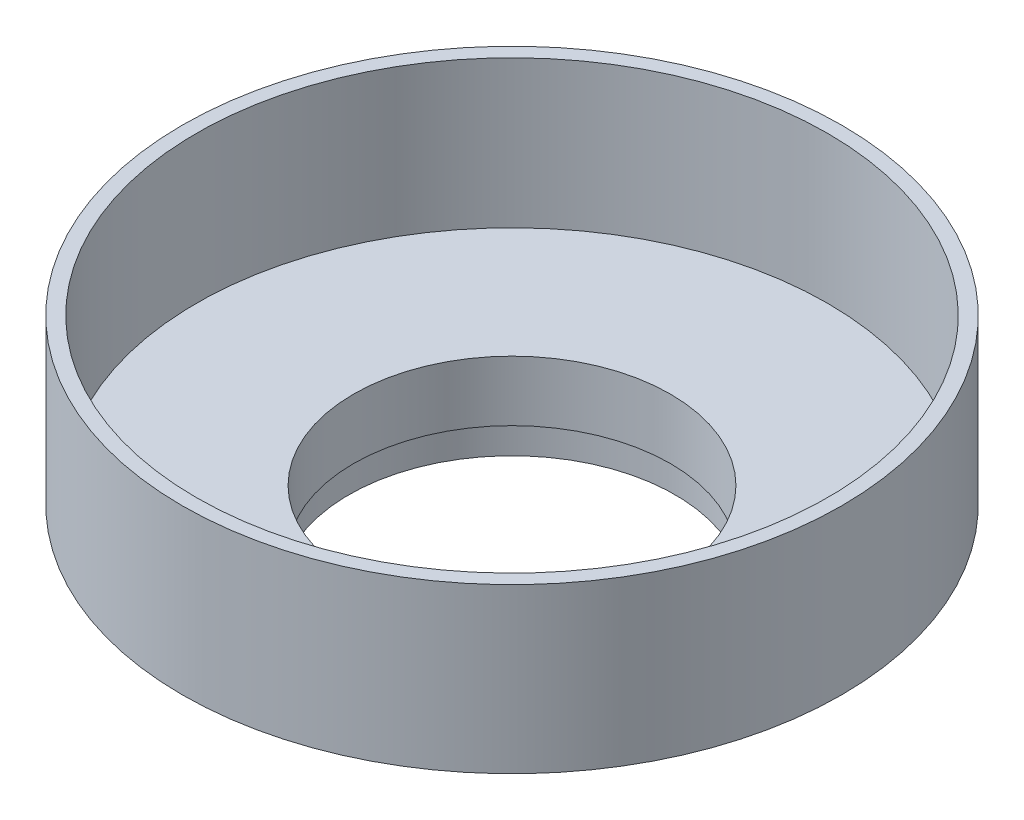
ISO-10303-21;
HEADER;
FILE_DESCRIPTION(('STEP AP214'),'2;1');
FILE_NAME('part.step','',(''),(''),'','','');
FILE_SCHEMA(('AUTOMOTIVE_DESIGN { 1 0 10303 214 1 1 1 1 }'));
ENDSEC;
DATA;
#1=APPLICATION_CONTEXT('core data for automotive mechanical design processes');
#2=APPLICATION_PROTOCOL_DEFINITION('international standard','automotive_design',2000,#1);
#3=PRODUCT_CONTEXT('',#1,'mechanical');
#4=PRODUCT('Part','Part','',(#3));
#5=PRODUCT_RELATED_PRODUCT_CATEGORY('part','',(#4));
#6=PRODUCT_DEFINITION_FORMATION('','',#4);
#7=PRODUCT_DEFINITION_CONTEXT('part definition',#1,'design');
#8=PRODUCT_DEFINITION('design','',#6,#7);
#9=PRODUCT_DEFINITION_SHAPE('','',#8);
#10=(LENGTH_UNIT() NAMED_UNIT(*) SI_UNIT(.MILLI.,.METRE.));
#11=(NAMED_UNIT(*) PLANE_ANGLE_UNIT() SI_UNIT($,.RADIAN.));
#12=(NAMED_UNIT(*) SI_UNIT($,.STERADIAN.) SOLID_ANGLE_UNIT());
#13=UNCERTAINTY_MEASURE_WITH_UNIT(LENGTH_MEASURE(1.E-05),#10,'distance_accuracy_value','');
#14=(GEOMETRIC_REPRESENTATION_CONTEXT(3) GLOBAL_UNCERTAINTY_ASSIGNED_CONTEXT((#13)) GLOBAL_UNIT_ASSIGNED_CONTEXT((#10,
#11,#12)) REPRESENTATION_CONTEXT('',''));
#15=CARTESIAN_POINT('',(0.,0.,0.));
#16=DIRECTION('',(0.,0.,1.));
#17=DIRECTION('',(1.,0.,0.));
#18=AXIS2_PLACEMENT_3D('',#15,#16,#17);
#19=CARTESIAN_POINT('',(71.12,0.,0.));
#20=DIRECTION('',(0.,-1.,0.));
#21=DIRECTION('',(0.,0.,-1.));
#22=AXIS2_PLACEMENT_3D('',#19,#20,#21);
#23=PLANE('',#22);
#24=CARTESIAN_POINT('',(0.,0.,0.));
#25=DIRECTION('',(0.,1.,0.));
#26=DIRECTION('',(0.,0.,1.));
#27=AXIS2_PLACEMENT_3D('',#24,#25,#26);
#28=CIRCLE('',#27,68.072);
#29=CARTESIAN_POINT('',(0.,0.,68.072));
#30=VERTEX_POINT('',#29);
#31=EDGE_CURVE('E73',#30,#30,#28,.T.);
#32=ORIENTED_EDGE('',*,*,#31,.F.);
#33=EDGE_LOOP('',(#32));
#34=FACE_BOUND('',#33,.T.);
#35=CARTESIAN_POINT('',(0.,0.,0.));
#36=DIRECTION('',(0.,1.,0.));
#37=DIRECTION('',(0.,0.,1.));
#38=AXIS2_PLACEMENT_3D('',#35,#36,#37);
#39=CIRCLE('',#38,71.12);
#40=CARTESIAN_POINT('',(0.,0.,71.12));
#41=VERTEX_POINT('',#40);
#42=EDGE_CURVE('E10',#41,#41,#39,.T.);
#43=ORIENTED_EDGE('',*,*,#42,.T.);
#44=EDGE_LOOP('',(#43));
#45=FACE_BOUND('',#44,.T.);
#46=ADVANCED_FACE('F30',(#34,#45),#23,.F.);
#47=CARTESIAN_POINT('',(0.,0.,0.));
#48=DIRECTION('',(0.,1.,0.));
#49=DIRECTION('',(0.,0.,1.));
#50=AXIS2_PLACEMENT_3D('',#47,#48,#49);
#51=CYLINDRICAL_SURFACE('',#50,71.12);
#52=ORIENTED_EDGE('',*,*,#42,.F.);
#53=EDGE_LOOP('',(#52));
#54=FACE_BOUND('',#53,.T.);
#55=CARTESIAN_POINT('',(0.,-35.3255807449288,0.));
#56=DIRECTION('',(0.,1.,0.));
#57=DIRECTION('',(0.,0.,1.));
#58=AXIS2_PLACEMENT_3D('',#55,#56,#57);
#59=CIRCLE('',#58,71.12);
#60=CARTESIAN_POINT('',(0.,-35.3255807449288,71.12));
#61=VERTEX_POINT('',#60);
#62=EDGE_CURVE('E36',#61,#61,#59,.T.);
#63=ORIENTED_EDGE('',*,*,#62,.T.);
#64=EDGE_LOOP('',(#63));
#65=FACE_BOUND('',#64,.T.);
#66=ADVANCED_FACE('F80',(#54,#65),#51,.T.);
#67=CARTESIAN_POINT('',(0.,-36.2230565304709,0.));
#68=DIRECTION('',(0.,1.,0.));
#69=DIRECTION('',(0.,0.,1.));
#70=AXIS2_PLACEMENT_3D('',#67,#68,#69);
#71=CONICAL_SURFACE('',#70,68.6542055447156,1.22173047639603);
#72=ORIENTED_EDGE('',*,*,#62,.F.);
#73=EDGE_LOOP('',(#72));
#74=FACE_BOUND('',#73,.T.);
#75=CARTESIAN_POINT('',(0.,-36.2230565304709,0.));
#76=DIRECTION('',(0.,1.,0.));
#77=DIRECTION('',(0.,0.,1.));
#78=AXIS2_PLACEMENT_3D('',#75,#76,#77);
#79=CIRCLE('',#78,68.6542055447156);
#80=CARTESIAN_POINT('',(0.,-36.2230565304709,68.6542055447156));
#81=VERTEX_POINT('',#80);
#82=EDGE_CURVE('E40',#81,#81,#79,.T.);
#83=ORIENTED_EDGE('',*,*,#82,.T.);
#84=EDGE_LOOP('',(#83));
#85=FACE_BOUND('',#84,.T.);
#86=ADVANCED_FACE('F84',(#74,#85),#71,.T.);
#87=CARTESIAN_POINT('',(68.6542055447156,-36.2230565304709,0.));
#88=DIRECTION('',(0.,1.,0.));
#89=DIRECTION('',(0.,0.,1.));
#90=AXIS2_PLACEMENT_3D('',#87,#88,#89);
#91=PLANE('',#90);
#92=ORIENTED_EDGE('',*,*,#82,.F.);
#93=EDGE_LOOP('',(#92));
#94=FACE_BOUND('',#93,.T.);
#95=CARTESIAN_POINT('',(0.,-36.2230565304709,0.));
#96=DIRECTION('',(0.,1.,0.));
#97=DIRECTION('',(0.,0.,1.));
#98=AXIS2_PLACEMENT_3D('',#95,#96,#97);
#99=CIRCLE('',#98,34.7623663336065);
#100=CARTESIAN_POINT('',(0.,-36.2230565304709,34.7623663336065));
#101=VERTEX_POINT('',#100);
#102=EDGE_CURVE('E44',#101,#101,#99,.T.);
#103=ORIENTED_EDGE('',*,*,#102,.T.);
#104=EDGE_LOOP('',(#103));
#105=FACE_BOUND('',#104,.T.);
#106=ADVANCED_FACE('F89',(#94,#105),#91,.F.);
#107=CARTESIAN_POINT('',(0.,0.,0.));
#108=DIRECTION('',(0.,1.,0.));
#109=DIRECTION('',(0.,0.,1.));
#110=AXIS2_PLACEMENT_3D('',#107,#108,#109);
#111=CYLINDRICAL_SURFACE('',#110,34.7623663336065);
#112=ORIENTED_EDGE('',*,*,#102,.F.);
#113=EDGE_LOOP('',(#112));
#114=FACE_BOUND('',#113,.T.);
#115=CARTESIAN_POINT('',(0.,-44.4840737597379,0.));
#116=DIRECTION('',(0.,1.,0.));
#117=DIRECTION('',(0.,0.,1.));
#118=AXIS2_PLACEMENT_3D('',#115,#116,#117);
#119=CIRCLE('',#118,34.7623663336065);
#120=CARTESIAN_POINT('',(0.,-44.4840737597379,34.7623663336065));
#121=VERTEX_POINT('',#120);
#122=EDGE_CURVE('E49',#121,#121,#119,.T.);
#123=ORIENTED_EDGE('',*,*,#122,.T.);
#124=EDGE_LOOP('',(#123));
#125=FACE_BOUND('',#124,.T.);
#126=ADVANCED_FACE('F95',(#114,#125),#111,.T.);
#127=CARTESIAN_POINT('',(34.7623663336065,-44.4840737597379,0.));
#128=DIRECTION('',(0.,-1.,0.));
#129=DIRECTION('',(0.,0.,-1.));
#130=AXIS2_PLACEMENT_3D('',#127,#128,#129);
#131=PLANE('',#130);
#132=ORIENTED_EDGE('',*,*,#122,.F.);
#133=EDGE_LOOP('',(#132));
#134=FACE_BOUND('',#133,.T.);
#135=CARTESIAN_POINT('',(0.,-44.4840737597379,0.));
#136=DIRECTION('',(0.,1.,0.));
#137=DIRECTION('',(0.,0.,1.));
#138=AXIS2_PLACEMENT_3D('',#135,#136,#137);
#139=CIRCLE('',#138,35.5563648487078);
#140=CARTESIAN_POINT('',(0.,-44.4840737597379,35.5563648487078));
#141=VERTEX_POINT('',#140);
#142=EDGE_CURVE('E52',#141,#141,#139,.T.);
#143=ORIENTED_EDGE('',*,*,#142,.T.);
#144=EDGE_LOOP('',(#143));
#145=FACE_BOUND('',#144,.T.);
#146=ADVANCED_FACE('F99',(#134,#145),#131,.F.);
#147=CARTESIAN_POINT('',(0.,0.,0.));
#148=DIRECTION('',(0.,1.,0.));
#149=DIRECTION('',(0.,0.,1.));
#150=AXIS2_PLACEMENT_3D('',#147,#148,#149);
#151=CYLINDRICAL_SURFACE('',#150,35.5563648487078);
#152=ORIENTED_EDGE('',*,*,#142,.F.);
#153=EDGE_LOOP('',(#152));
#154=FACE_BOUND('',#153,.T.);
#155=CARTESIAN_POINT('',(0.,-51.0880737597379,0.));
#156=DIRECTION('',(0.,1.,0.));
#157=DIRECTION('',(0.,0.,1.));
#158=AXIS2_PLACEMENT_3D('',#155,#156,#157);
#159=CIRCLE('',#158,35.5563648487078);
#160=CARTESIAN_POINT('',(0.,-51.0880737597379,35.5563648487078));
#161=VERTEX_POINT('',#160);
#162=EDGE_CURVE('E55',#161,#161,#159,.T.);
#163=ORIENTED_EDGE('',*,*,#162,.T.);
#164=EDGE_LOOP('',(#163));
#165=FACE_BOUND('',#164,.T.);
#166=ADVANCED_FACE('F103',(#154,#165),#151,.T.);
#167=CARTESIAN_POINT('',(35.1869318546596,-51.0880737597379,0.));
#168=DIRECTION('',(0.,1.,0.));
#169=DIRECTION('',(0.,0.,1.));
#170=AXIS2_PLACEMENT_3D('',#167,#168,#169);
#171=PLANE('',#170);
#172=ORIENTED_EDGE('',*,*,#162,.F.);
#173=EDGE_LOOP('',(#172));
#174=FACE_BOUND('',#173,.T.);
#175=CARTESIAN_POINT('',(0.,-51.0880737597379,0.));
#176=DIRECTION('',(0.,1.,0.));
#177=DIRECTION('',(0.,0.,1.));
#178=AXIS2_PLACEMENT_3D('',#175,#176,#177);
#179=CIRCLE('',#178,35.1869318546596);
#180=CARTESIAN_POINT('',(0.,-51.0880737597379,35.1869318546596));
#181=VERTEX_POINT('',#180);
#182=EDGE_CURVE('E58',#181,#181,#179,.T.);
#183=ORIENTED_EDGE('',*,*,#182,.T.);
#184=EDGE_LOOP('',(#183));
#185=FACE_BOUND('',#184,.T.);
#186=ADVANCED_FACE('F107',(#174,#185),#171,.F.);
#187=CARTESIAN_POINT('',(0.,0.,0.));
#188=DIRECTION('',(0.,1.,0.));
#189=DIRECTION('',(0.,0.,1.));
#190=AXIS2_PLACEMENT_3D('',#187,#188,#189);
#191=CYLINDRICAL_SURFACE('',#190,35.1869318546596);
#192=ORIENTED_EDGE('',*,*,#182,.F.);
#193=EDGE_LOOP('',(#192));
#194=FACE_BOUND('',#193,.T.);
#195=CARTESIAN_POINT('',(0.,-44.7380737597379,0.));
#196=DIRECTION('',(0.,1.,0.));
#197=DIRECTION('',(0.,0.,1.));
#198=AXIS2_PLACEMENT_3D('',#195,#196,#197);
#199=CIRCLE('',#198,35.1869318546596);
#200=CARTESIAN_POINT('',(0.,-44.7380737597379,35.1869318546596));
#201=VERTEX_POINT('',#200);
#202=EDGE_CURVE('E61',#201,#201,#199,.T.);
#203=ORIENTED_EDGE('',*,*,#202,.T.);
#204=EDGE_LOOP('',(#203));
#205=FACE_BOUND('',#204,.T.);
#206=ADVANCED_FACE('F111',(#194,#205),#191,.F.);
#207=CARTESIAN_POINT('',(34.163,-44.7380737597379,0.));
#208=DIRECTION('',(0.,1.,0.));
#209=DIRECTION('',(0.,0.,1.));
#210=AXIS2_PLACEMENT_3D('',#207,#208,#209);
#211=PLANE('',#210);
#212=ORIENTED_EDGE('',*,*,#202,.F.);
#213=EDGE_LOOP('',(#212));
#214=FACE_BOUND('',#213,.T.);
#215=CARTESIAN_POINT('',(0.,-44.7380737597379,0.));
#216=DIRECTION('',(0.,1.,0.));
#217=DIRECTION('',(0.,0.,1.));
#218=AXIS2_PLACEMENT_3D('',#215,#216,#217);
#219=CIRCLE('',#218,34.163);
#220=CARTESIAN_POINT('',(0.,-44.7380737597379,34.163));
#221=VERTEX_POINT('',#220);
#222=EDGE_CURVE('E64',#221,#221,#219,.T.);
#223=ORIENTED_EDGE('',*,*,#222,.T.);
#224=EDGE_LOOP('',(#223));
#225=FACE_BOUND('',#224,.T.);
#226=ADVANCED_FACE('F115',(#214,#225),#211,.F.);
#227=CARTESIAN_POINT('',(0.,0.,0.));
#228=DIRECTION('',(0.,1.,0.));
#229=DIRECTION('',(0.,0.,1.));
#230=AXIS2_PLACEMENT_3D('',#227,#228,#229);
#231=CYLINDRICAL_SURFACE('',#230,34.163);
#232=ORIENTED_EDGE('',*,*,#222,.F.);
#233=EDGE_LOOP('',(#232));
#234=FACE_BOUND('',#233,.T.);
#235=CARTESIAN_POINT('',(0.,-31.7586737597379,0.));
#236=DIRECTION('',(0.,1.,0.));
#237=DIRECTION('',(0.,0.,1.));
#238=AXIS2_PLACEMENT_3D('',#235,#236,#237);
#239=CIRCLE('',#238,34.163);
#240=CARTESIAN_POINT('',(0.,-31.7586737597379,34.163));
#241=VERTEX_POINT('',#240);
#242=EDGE_CURVE('E67',#241,#241,#239,.T.);
#243=ORIENTED_EDGE('',*,*,#242,.T.);
#244=EDGE_LOOP('',(#243));
#245=FACE_BOUND('',#244,.T.);
#246=ADVANCED_FACE('F119',(#234,#245),#231,.F.);
#247=CARTESIAN_POINT('',(34.163,-31.7586737597379,0.));
#248=DIRECTION('',(0.,-1.,0.));
#249=DIRECTION('',(0.,0.,-1.));
#250=AXIS2_PLACEMENT_3D('',#247,#248,#249);
#251=PLANE('',#250);
#252=ORIENTED_EDGE('',*,*,#242,.F.);
#253=EDGE_LOOP('',(#252));
#254=FACE_BOUND('',#253,.T.);
#255=CARTESIAN_POINT('',(0.,-31.7586737597379,0.));
#256=DIRECTION('',(0.,1.,0.));
#257=DIRECTION('',(0.,0.,1.));
#258=AXIS2_PLACEMENT_3D('',#255,#256,#257);
#259=CIRCLE('',#258,68.072);
#260=CARTESIAN_POINT('',(0.,-31.7586737597379,68.072));
#261=VERTEX_POINT('',#260);
#262=EDGE_CURVE('E70',#261,#261,#259,.T.);
#263=ORIENTED_EDGE('',*,*,#262,.T.);
#264=EDGE_LOOP('',(#263));
#265=FACE_BOUND('',#264,.T.);
#266=ADVANCED_FACE('F123',(#254,#265),#251,.F.);
#267=CARTESIAN_POINT('',(0.,0.,0.));
#268=DIRECTION('',(0.,1.,0.));
#269=DIRECTION('',(0.,0.,1.));
#270=AXIS2_PLACEMENT_3D('',#267,#268,#269);
#271=CYLINDRICAL_SURFACE('',#270,68.072);
#272=ORIENTED_EDGE('',*,*,#262,.F.);
#273=EDGE_LOOP('',(#272));
#274=FACE_BOUND('',#273,.T.);
#275=ORIENTED_EDGE('',*,*,#31,.T.);
#276=EDGE_LOOP('',(#275));
#277=FACE_BOUND('',#276,.T.);
#278=ADVANCED_FACE('F77',(#274,#277),#271,.F.);
#279=CLOSED_SHELL('',(#46,#66,#86,#106,#126,#146,#166,#186,#206,#226,#246,#266,#278));
#280=MANIFOLD_SOLID_BREP('B2',#279);
#281=ADVANCED_BREP_SHAPE_REPRESENTATION('',(#18,#280),#14);
#282=SHAPE_DEFINITION_REPRESENTATION(#9,#281);
ENDSEC;
END-ISO-10303-21;
